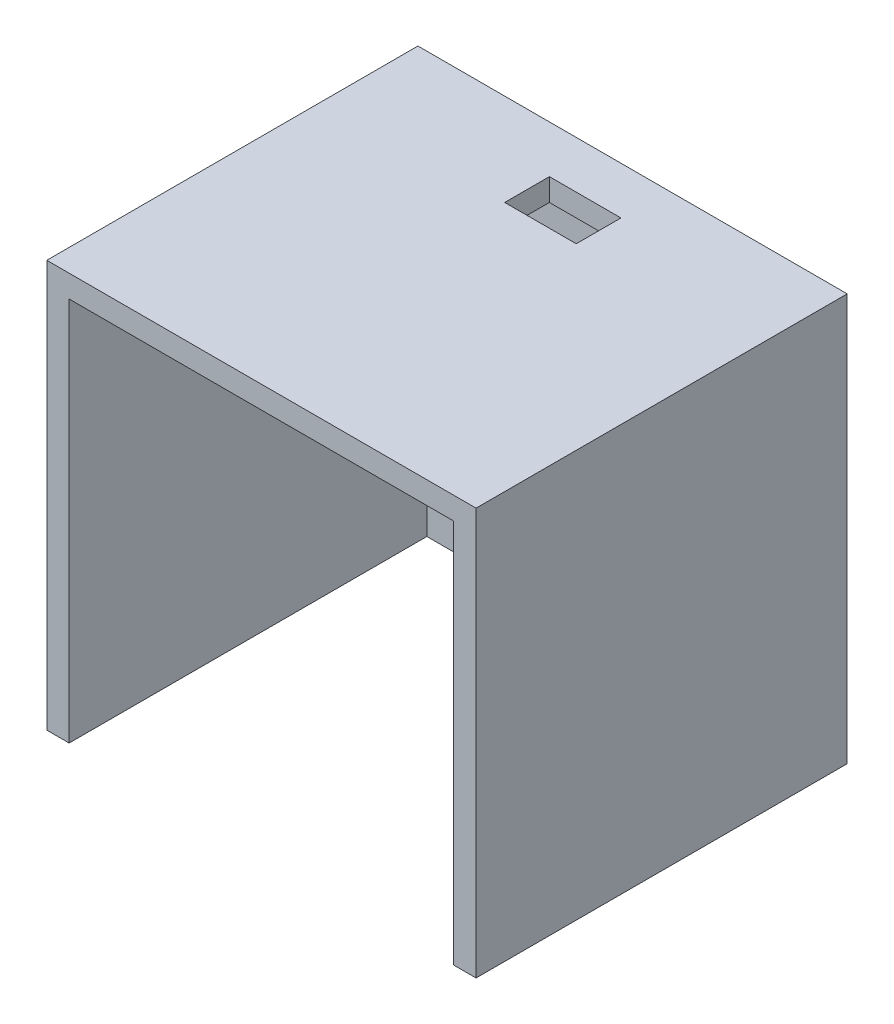
ISO-10303-21;
HEADER;
FILE_DESCRIPTION(('STEP AP214'),'2;1');
FILE_NAME('part.step','',(''),(''),'','','');
FILE_SCHEMA(('AUTOMOTIVE_DESIGN { 1 0 10303 214 1 1 1 1 }'));
ENDSEC;
DATA;
#1=APPLICATION_CONTEXT('core data for automotive mechanical design processes');
#2=APPLICATION_PROTOCOL_DEFINITION('international standard','automotive_design',2000,#1);
#3=PRODUCT_CONTEXT('',#1,'mechanical');
#4=PRODUCT('Part','Part','',(#3));
#5=PRODUCT_RELATED_PRODUCT_CATEGORY('part','',(#4));
#6=PRODUCT_DEFINITION_FORMATION('','',#4);
#7=PRODUCT_DEFINITION_CONTEXT('part definition',#1,'design');
#8=PRODUCT_DEFINITION('design','',#6,#7);
#9=PRODUCT_DEFINITION_SHAPE('','',#8);
#10=(LENGTH_UNIT() NAMED_UNIT(*) SI_UNIT(.MILLI.,.METRE.));
#11=(NAMED_UNIT(*) PLANE_ANGLE_UNIT() SI_UNIT($,.RADIAN.));
#12=(NAMED_UNIT(*) SI_UNIT($,.STERADIAN.) SOLID_ANGLE_UNIT());
#13=UNCERTAINTY_MEASURE_WITH_UNIT(LENGTH_MEASURE(1.E-05),#10,'distance_accuracy_value','');
#14=(GEOMETRIC_REPRESENTATION_CONTEXT(3) GLOBAL_UNCERTAINTY_ASSIGNED_CONTEXT((#13)) GLOBAL_UNIT_ASSIGNED_CONTEXT((#10,
#11,#12)) REPRESENTATION_CONTEXT('',''));
#15=CARTESIAN_POINT('',(0.,0.,0.));
#16=DIRECTION('',(0.,0.,1.));
#17=DIRECTION('',(1.,0.,0.));
#18=AXIS2_PLACEMENT_3D('',#15,#16,#17);
#19=CARTESIAN_POINT('',(0.,0.,40.));
#20=DIRECTION('',(0.,0.,-1.));
#21=DIRECTION('',(-1.,0.,0.));
#22=AXIS2_PLACEMENT_3D('',#19,#20,#21);
#23=PLANE('',#22);
#24=DIRECTION('',(0.,-1.,0.));
#25=VECTOR('',#24,1.);
#26=CARTESIAN_POINT('',(-2.49999999999993,43.0000000000001,40.));
#27=LINE('',#26,#25);
#28=CARTESIAN_POINT('',(-2.49999999999988,45.5000000000001,40.));
#29=VERTEX_POINT('',#28);
#30=CARTESIAN_POINT('',(-2.50000000000008,0.,40.));
#31=VERTEX_POINT('',#30);
#32=EDGE_CURVE('E154',#29,#31,#27,.T.);
#33=ORIENTED_EDGE('',*,*,#32,.T.);
#34=DIRECTION('',(-1.,0.,0.));
#35=VECTOR('',#34,1.);
#36=CARTESIAN_POINT('',(-4.22762533667264,0.,40.));
#37=LINE('',#36,#35);
#38=CARTESIAN_POINT('',(0.,0.,40.));
#39=VERTEX_POINT('',#38);
#40=EDGE_CURVE('E147',#39,#31,#37,.T.);
#41=ORIENTED_EDGE('',*,*,#40,.F.);
#42=DIRECTION('',(0.,-1.,0.));
#43=VECTOR('',#42,1.);
#44=CARTESIAN_POINT('',(0.,0.,40.));
#45=LINE('',#44,#43);
#46=CARTESIAN_POINT('',(0.,43.,40.));
#47=VERTEX_POINT('',#46);
#48=EDGE_CURVE('E184',#47,#39,#45,.T.);
#49=ORIENTED_EDGE('',*,*,#48,.F.);
#50=DIRECTION('',(-1.,0.,0.));
#51=VECTOR('',#50,1.);
#52=CARTESIAN_POINT('',(0.,43.,40.));
#53=LINE('',#52,#51);
#54=CARTESIAN_POINT('',(43.,43.,40.));
#55=VERTEX_POINT('',#54);
#56=EDGE_CURVE('E189',#55,#47,#53,.T.);
#57=ORIENTED_EDGE('',*,*,#56,.F.);
#58=DIRECTION('',(0.,1.,0.));
#59=VECTOR('',#58,1.);
#60=CARTESIAN_POINT('',(43.,0.,40.));
#61=LINE('',#60,#59);
#62=CARTESIAN_POINT('',(43.,0.,40.));
#63=VERTEX_POINT('',#62);
#64=EDGE_CURVE('E146',#63,#55,#61,.T.);
#65=ORIENTED_EDGE('',*,*,#64,.F.);
#66=CARTESIAN_POINT('',(45.5,0.,40.));
#67=VERTEX_POINT('',#66);
#68=EDGE_CURVE('E132',#67,#63,#37,.T.);
#69=ORIENTED_EDGE('',*,*,#68,.F.);
#70=DIRECTION('',(0.,1.,0.));
#71=VECTOR('',#70,1.);
#72=CARTESIAN_POINT('',(45.5000000000001,42.9999999999999,40.));
#73=LINE('',#72,#71);
#74=CARTESIAN_POINT('',(45.5000000000002,45.4999999999997,40.));
#75=VERTEX_POINT('',#74);
#76=EDGE_CURVE('E142',#67,#75,#73,.T.);
#77=ORIENTED_EDGE('',*,*,#76,.T.);
#78=DIRECTION('',(-1.,0.,0.));
#79=VECTOR('',#78,1.);
#80=CARTESIAN_POINT('',(-2.49999999999988,45.5000000000001,40.));
#81=LINE('',#80,#79);
#82=EDGE_CURVE('E151',#75,#29,#81,.T.);
#83=ORIENTED_EDGE('',*,*,#82,.T.);
#84=EDGE_LOOP('',(#33,#41,#49,#57,#65,#69,#77,#83));
#85=FACE_BOUND('',#84,.T.);
#86=ADVANCED_FACE('F41',(#85),#23,.F.);
#87=CARTESIAN_POINT('',(-2.49999999999988,45.5000000000001,40.));
#88=DIRECTION('',(0.,-1.,0.));
#89=DIRECTION('',(1.,0.,0.));
#90=AXIS2_PLACEMENT_3D('',#87,#88,#89);
#91=PLANE('',#90);
#92=DIRECTION('',(0.,0.,-1.));
#93=VECTOR('',#92,1.);
#94=CARTESIAN_POINT('',(25.5000000000001,45.4999999999999,3.79999999999999));
#95=LINE('',#94,#93);
#96=CARTESIAN_POINT('',(25.5000000000001,45.4999999999999,8.79999999999998));
#97=VERTEX_POINT('',#96);
#98=CARTESIAN_POINT('',(25.5000000000001,45.4999999999999,3.79999999999999));
#99=VERTEX_POINT('',#98);
#100=EDGE_CURVE('E233',#97,#99,#95,.T.);
#101=ORIENTED_EDGE('',*,*,#100,.F.);
#102=DIRECTION('',(1.,0.,0.));
#103=VECTOR('',#102,1.);
#104=CARTESIAN_POINT('',(25.5000000000001,45.4999999999999,8.79999999999998));
#105=LINE('',#104,#103);
#106=CARTESIAN_POINT('',(17.5,45.5,8.79999999999999));
#107=VERTEX_POINT('',#106);
#108=EDGE_CURVE('E230',#107,#97,#105,.T.);
#109=ORIENTED_EDGE('',*,*,#108,.F.);
#110=DIRECTION('',(0.,0.,1.));
#111=VECTOR('',#110,1.);
#112=CARTESIAN_POINT('',(17.5,45.5,3.8));
#113=LINE('',#112,#111);
#114=CARTESIAN_POINT('',(17.5,45.5,3.8));
#115=VERTEX_POINT('',#114);
#116=EDGE_CURVE('E227',#115,#107,#113,.T.);
#117=ORIENTED_EDGE('',*,*,#116,.F.);
#118=DIRECTION('',(-1.,0.,0.));
#119=VECTOR('',#118,1.);
#120=CARTESIAN_POINT('',(17.5,45.5,3.8));
#121=LINE('',#120,#119);
#122=EDGE_CURVE('E64',#99,#115,#121,.T.);
#123=ORIENTED_EDGE('',*,*,#122,.F.);
#124=EDGE_LOOP('',(#101,#109,#117,#123));
#125=FACE_BOUND('',#124,.T.);
#126=DIRECTION('',(0.,0.,-1.));
#127=VECTOR('',#126,1.);
#128=CARTESIAN_POINT('',(45.5000000000002,45.4999999999997,40.));
#129=LINE('',#128,#127);
#130=CARTESIAN_POINT('',(45.5,45.5000000000001,-1.5));
#131=VERTEX_POINT('',#130);
#132=EDGE_CURVE('E11',#75,#131,#129,.T.);
#133=ORIENTED_EDGE('',*,*,#132,.T.);
#134=DIRECTION('',(-1.,0.,0.));
#135=VECTOR('',#134,1.);
#136=CARTESIAN_POINT('',(-2.49999999999988,45.5000000000001,-1.5));
#137=LINE('',#136,#135);
#138=CARTESIAN_POINT('',(-2.49999999999988,45.5000000000001,-1.5));
#139=VERTEX_POINT('',#138);
#140=EDGE_CURVE('E173',#131,#139,#137,.T.);
#141=ORIENTED_EDGE('',*,*,#140,.T.);
#142=DIRECTION('',(0.,0.,-1.));
#143=VECTOR('',#142,1.);
#144=CARTESIAN_POINT('',(-2.49999999999988,45.5000000000001,40.));
#145=LINE('',#144,#143);
#146=EDGE_CURVE('E49',#29,#139,#145,.T.);
#147=ORIENTED_EDGE('',*,*,#146,.F.);
#148=ORIENTED_EDGE('',*,*,#82,.F.);
#149=EDGE_LOOP('',(#133,#141,#147,#148));
#150=FACE_BOUND('',#149,.T.);
#151=ADVANCED_FACE('F43',(#125,#150),#91,.F.);
#152=CARTESIAN_POINT('',(-2.49999999999993,43.0000000000001,40.));
#153=DIRECTION('',(1.,0.,0.));
#154=DIRECTION('',(0.,1.,0.));
#155=AXIS2_PLACEMENT_3D('',#152,#153,#154);
#156=PLANE('',#155);
#157=DIRECTION('',(0.,-1.,0.));
#158=VECTOR('',#157,1.);
#159=CARTESIAN_POINT('',(-2.49999999999988,45.5000000000001,-1.5));
#160=LINE('',#159,#158);
#161=CARTESIAN_POINT('',(-2.49999999999988,0.,-1.5));
#162=VERTEX_POINT('',#161);
#163=EDGE_CURVE('E167',#139,#162,#160,.T.);
#164=ORIENTED_EDGE('',*,*,#163,.T.);
#165=DIRECTION('',(0.,0.,-1.));
#166=VECTOR('',#165,1.);
#167=CARTESIAN_POINT('',(-2.50000000000007,0.,-1.501));
#168=LINE('',#167,#166);
#169=EDGE_CURVE('E56',#31,#162,#168,.T.);
#170=ORIENTED_EDGE('',*,*,#169,.F.);
#171=ORIENTED_EDGE('',*,*,#32,.F.);
#172=ORIENTED_EDGE('',*,*,#146,.T.);
#173=EDGE_LOOP('',(#164,#170,#171,#172));
#174=FACE_BOUND('',#173,.T.);
#175=ADVANCED_FACE('F166',(#174),#156,.F.);
#176=CARTESIAN_POINT('',(45.5000000000001,42.9999999999999,40.));
#177=DIRECTION('',(-1.,0.,0.));
#178=DIRECTION('',(0.,-1.,0.));
#179=AXIS2_PLACEMENT_3D('',#176,#177,#178);
#180=PLANE('',#179);
#181=ORIENTED_EDGE('',*,*,#76,.F.);
#182=DIRECTION('',(0.,0.,1.));
#183=VECTOR('',#182,1.);
#184=CARTESIAN_POINT('',(45.5,0.,-1.501));
#185=LINE('',#184,#183);
#186=CARTESIAN_POINT('',(45.5,0.,-1.5));
#187=VERTEX_POINT('',#186);
#188=EDGE_CURVE('E129',#187,#67,#185,.T.);
#189=ORIENTED_EDGE('',*,*,#188,.F.);
#190=DIRECTION('',(0.,1.,0.));
#191=VECTOR('',#190,1.);
#192=CARTESIAN_POINT('',(45.5,45.5000000000001,-1.5));
#193=LINE('',#192,#191);
#194=EDGE_CURVE('E174',#187,#131,#193,.T.);
#195=ORIENTED_EDGE('',*,*,#194,.T.);
#196=ORIENTED_EDGE('',*,*,#132,.F.);
#197=EDGE_LOOP('',(#181,#189,#195,#196));
#198=FACE_BOUND('',#197,.T.);
#199=ADVANCED_FACE('F150',(#198),#180,.F.);
#200=CARTESIAN_POINT('',(0.,0.,40.));
#201=DIRECTION('',(1.,0.,0.));
#202=DIRECTION('',(0.,0.,-1.));
#203=AXIS2_PLACEMENT_3D('',#200,#201,#202);
#204=PLANE('',#203);
#205=DIRECTION('',(0.,-1.,0.));
#206=VECTOR('',#205,1.);
#207=CARTESIAN_POINT('',(0.,0.,0.));
#208=LINE('',#207,#206);
#209=CARTESIAN_POINT('',(0.,43.,0.));
#210=VERTEX_POINT('',#209);
#211=CARTESIAN_POINT('',(0.,0.,0.));
#212=VERTEX_POINT('',#211);
#213=EDGE_CURVE('E177',#210,#212,#208,.T.);
#214=ORIENTED_EDGE('',*,*,#213,.F.);
#215=DIRECTION('',(0.,0.,-1.));
#216=VECTOR('',#215,1.);
#217=CARTESIAN_POINT('',(0.,43.,40.));
#218=LINE('',#217,#216);
#219=EDGE_CURVE('E190',#47,#210,#218,.T.);
#220=ORIENTED_EDGE('',*,*,#219,.F.);
#221=ORIENTED_EDGE('',*,*,#48,.T.);
#222=DIRECTION('',(0.,0.,-1.));
#223=VECTOR('',#222,1.);
#224=CARTESIAN_POINT('',(0.,0.,40.));
#225=LINE('',#224,#223);
#226=EDGE_CURVE('E152',#39,#212,#225,.T.);
#227=ORIENTED_EDGE('',*,*,#226,.T.);
#228=EDGE_LOOP('',(#214,#220,#221,#227));
#229=FACE_BOUND('',#228,.T.);
#230=ADVANCED_FACE('F210',(#229),#204,.T.);
#231=CARTESIAN_POINT('',(43.,0.,40.));
#232=DIRECTION('',(-1.,0.,0.));
#233=DIRECTION('',(0.,0.,1.));
#234=AXIS2_PLACEMENT_3D('',#231,#232,#233);
#235=PLANE('',#234);
#236=DIRECTION('',(0.,1.,0.));
#237=VECTOR('',#236,1.);
#238=CARTESIAN_POINT('',(43.,0.,0.));
#239=LINE('',#238,#237);
#240=CARTESIAN_POINT('',(43.,0.,0.));
#241=VERTEX_POINT('',#240);
#242=CARTESIAN_POINT('',(43.,43.,0.));
#243=VERTEX_POINT('',#242);
#244=EDGE_CURVE('E194',#241,#243,#239,.T.);
#245=ORIENTED_EDGE('',*,*,#244,.F.);
#246=DIRECTION('',(0.,0.,-1.));
#247=VECTOR('',#246,1.);
#248=CARTESIAN_POINT('',(43.,0.,40.));
#249=LINE('',#248,#247);
#250=EDGE_CURVE('E157',#63,#241,#249,.T.);
#251=ORIENTED_EDGE('',*,*,#250,.F.);
#252=ORIENTED_EDGE('',*,*,#64,.T.);
#253=DIRECTION('',(0.,0.,-1.));
#254=VECTOR('',#253,1.);
#255=CARTESIAN_POINT('',(43.,43.,40.));
#256=LINE('',#255,#254);
#257=EDGE_CURVE('E201',#55,#243,#256,.T.);
#258=ORIENTED_EDGE('',*,*,#257,.T.);
#259=EDGE_LOOP('',(#245,#251,#252,#258));
#260=FACE_BOUND('',#259,.T.);
#261=ADVANCED_FACE('F205',(#260),#235,.T.);
#262=CARTESIAN_POINT('',(0.,43.,40.));
#263=DIRECTION('',(0.,-1.,0.));
#264=DIRECTION('',(0.,0.,-1.));
#265=AXIS2_PLACEMENT_3D('',#262,#263,#264);
#266=PLANE('',#265);
#267=DIRECTION('',(1.,0.,0.));
#268=VECTOR('',#267,1.);
#269=CARTESIAN_POINT('',(25.4999999999997,43.,8.79999999999998));
#270=LINE('',#269,#268);
#271=CARTESIAN_POINT('',(17.5,43.,8.79999999999999));
#272=VERTEX_POINT('',#271);
#273=CARTESIAN_POINT('',(25.5,43.,8.79999999999998));
#274=VERTEX_POINT('',#273);
#275=EDGE_CURVE('E175',#272,#274,#270,.T.);
#276=ORIENTED_EDGE('',*,*,#275,.T.);
#277=DIRECTION('',(0.,0.,-1.));
#278=VECTOR('',#277,1.);
#279=CARTESIAN_POINT('',(25.5,43.,3.79999999999999));
#280=LINE('',#279,#278);
#281=CARTESIAN_POINT('',(25.5,43.,3.79999999999999));
#282=VERTEX_POINT('',#281);
#283=EDGE_CURVE('E218',#274,#282,#280,.T.);
#284=ORIENTED_EDGE('',*,*,#283,.T.);
#285=DIRECTION('',(-1.,0.,0.));
#286=VECTOR('',#285,1.);
#287=CARTESIAN_POINT('',(17.4999999999997,43.,3.8));
#288=LINE('',#287,#286);
#289=CARTESIAN_POINT('',(17.4999999999997,43.,3.8));
#290=VERTEX_POINT('',#289);
#291=EDGE_CURVE('E221',#282,#290,#288,.T.);
#292=ORIENTED_EDGE('',*,*,#291,.T.);
#293=DIRECTION('',(0.,0.,1.));
#294=VECTOR('',#293,1.);
#295=CARTESIAN_POINT('',(17.5,43.,3.8));
#296=LINE('',#295,#294);
#297=EDGE_CURVE('E224',#290,#272,#296,.T.);
#298=ORIENTED_EDGE('',*,*,#297,.T.);
#299=EDGE_LOOP('',(#276,#284,#292,#298));
#300=FACE_BOUND('',#299,.T.);
#301=DIRECTION('',(-1.,0.,0.));
#302=VECTOR('',#301,1.);
#303=CARTESIAN_POINT('',(0.,43.,0.));
#304=LINE('',#303,#302);
#305=EDGE_CURVE('E187',#243,#210,#304,.T.);
#306=ORIENTED_EDGE('',*,*,#305,.F.);
#307=ORIENTED_EDGE('',*,*,#257,.F.);
#308=ORIENTED_EDGE('',*,*,#56,.T.);
#309=ORIENTED_EDGE('',*,*,#219,.T.);
#310=EDGE_LOOP('',(#306,#307,#308,#309));
#311=FACE_BOUND('',#310,.T.);
#312=ADVANCED_FACE('F213',(#300,#311),#266,.T.);
#313=CARTESIAN_POINT('',(0.,0.,0.));
#314=DIRECTION('',(0.,0.,1.));
#315=DIRECTION('',(1.,0.,0.));
#316=AXIS2_PLACEMENT_3D('',#313,#314,#315);
#317=PLANE('',#316);
#318=ORIENTED_EDGE('',*,*,#244,.T.);
#319=ORIENTED_EDGE('',*,*,#305,.T.);
#320=ORIENTED_EDGE('',*,*,#213,.T.);
#321=DIRECTION('',(1.,0.,0.));
#322=VECTOR('',#321,1.);
#323=CARTESIAN_POINT('',(0.,0.,0.));
#324=LINE('',#323,#322);
#325=EDGE_CURVE('E180',#212,#241,#324,.T.);
#326=ORIENTED_EDGE('',*,*,#325,.T.);
#327=EDGE_LOOP('',(#318,#319,#320,#326));
#328=FACE_BOUND('',#327,.T.);
#329=ADVANCED_FACE('F207',(#328),#317,.T.);
#330=CARTESIAN_POINT('',(0.,0.,-1.5));
#331=DIRECTION('',(0.,0.,1.));
#332=DIRECTION('',(1.,0.,0.));
#333=AXIS2_PLACEMENT_3D('',#330,#331,#332);
#334=PLANE('',#333);
#335=ORIENTED_EDGE('',*,*,#194,.F.);
#336=DIRECTION('',(1.,0.,0.));
#337=VECTOR('',#336,1.);
#338=CARTESIAN_POINT('',(-4.22762533667264,0.,-1.5));
#339=LINE('',#338,#337);
#340=EDGE_CURVE('E134',#162,#187,#339,.T.);
#341=ORIENTED_EDGE('',*,*,#340,.F.);
#342=ORIENTED_EDGE('',*,*,#163,.F.);
#343=ORIENTED_EDGE('',*,*,#140,.F.);
#344=EDGE_LOOP('',(#335,#341,#342,#343));
#345=FACE_BOUND('',#344,.T.);
#346=ADVANCED_FACE('F172',(#345),#334,.F.);
#347=CARTESIAN_POINT('',(25.4999999999997,-2.50100000000019,8.79999999999998));
#348=DIRECTION('',(0.,0.,1.));
#349=DIRECTION('',(1.,0.,0.));
#350=AXIS2_PLACEMENT_3D('',#347,#348,#349);
#351=PLANE('',#350);
#352=DIRECTION('',(0.,1.,0.));
#353=VECTOR('',#352,1.);
#354=CARTESIAN_POINT('',(17.4999999999997,-2.50100000000013,8.79999999999999));
#355=LINE('',#354,#353);
#356=EDGE_CURVE('E237',#272,#107,#355,.T.);
#357=ORIENTED_EDGE('',*,*,#356,.T.);
#358=ORIENTED_EDGE('',*,*,#108,.T.);
#359=DIRECTION('',(0.,1.,0.));
#360=VECTOR('',#359,1.);
#361=CARTESIAN_POINT('',(25.4999999999997,-2.50100000000019,8.79999999999998));
#362=LINE('',#361,#360);
#363=EDGE_CURVE('E242',#274,#97,#362,.T.);
#364=ORIENTED_EDGE('',*,*,#363,.F.);
#365=ORIENTED_EDGE('',*,*,#275,.F.);
#366=EDGE_LOOP('',(#357,#358,#364,#365));
#367=FACE_BOUND('',#366,.T.);
#368=ADVANCED_FACE('F250',(#367),#351,.F.);
#369=CARTESIAN_POINT('',(25.4999999999997,-2.50100000000019,3.79999999999999));
#370=DIRECTION('',(1.,0.,0.));
#371=DIRECTION('',(0.,1.,0.));
#372=AXIS2_PLACEMENT_3D('',#369,#370,#371);
#373=PLANE('',#372);
#374=ORIENTED_EDGE('',*,*,#363,.T.);
#375=ORIENTED_EDGE('',*,*,#100,.T.);
#376=DIRECTION('',(0.,1.,0.));
#377=VECTOR('',#376,1.);
#378=CARTESIAN_POINT('',(25.4999999999997,-2.50100000000019,3.79999999999999));
#379=LINE('',#378,#377);
#380=EDGE_CURVE('E240',#282,#99,#379,.T.);
#381=ORIENTED_EDGE('',*,*,#380,.F.);
#382=ORIENTED_EDGE('',*,*,#283,.F.);
#383=EDGE_LOOP('',(#374,#375,#381,#382));
#384=FACE_BOUND('',#383,.T.);
#385=ADVANCED_FACE('F254',(#384),#373,.F.);
#386=CARTESIAN_POINT('',(17.4999999999997,-2.50100000000013,3.8));
#387=DIRECTION('',(0.,0.,-1.));
#388=DIRECTION('',(-1.,0.,0.));
#389=AXIS2_PLACEMENT_3D('',#386,#387,#388);
#390=PLANE('',#389);
#391=ORIENTED_EDGE('',*,*,#380,.T.);
#392=ORIENTED_EDGE('',*,*,#122,.T.);
#393=DIRECTION('',(0.,1.,0.));
#394=VECTOR('',#393,1.);
#395=CARTESIAN_POINT('',(17.4999999999997,-2.50100000000013,3.8));
#396=LINE('',#395,#394);
#397=EDGE_CURVE('E238',#290,#115,#396,.T.);
#398=ORIENTED_EDGE('',*,*,#397,.F.);
#399=ORIENTED_EDGE('',*,*,#291,.F.);
#400=EDGE_LOOP('',(#391,#392,#398,#399));
#401=FACE_BOUND('',#400,.T.);
#402=ADVANCED_FACE('F256',(#401),#390,.F.);
#403=CARTESIAN_POINT('',(17.4999999999997,-2.50100000000013,3.8));
#404=DIRECTION('',(-1.,0.,0.));
#405=DIRECTION('',(0.,-1.,0.));
#406=AXIS2_PLACEMENT_3D('',#403,#404,#405);
#407=PLANE('',#406);
#408=ORIENTED_EDGE('',*,*,#397,.T.);
#409=ORIENTED_EDGE('',*,*,#116,.T.);
#410=ORIENTED_EDGE('',*,*,#356,.F.);
#411=ORIENTED_EDGE('',*,*,#297,.F.);
#412=EDGE_LOOP('',(#408,#409,#410,#411));
#413=FACE_BOUND('',#412,.T.);
#414=ADVANCED_FACE('F259',(#413),#407,.F.);
#415=CARTESIAN_POINT('',(-4.22762533667264,0.,-1.501));
#416=DIRECTION('',(0.,1.,0.));
#417=DIRECTION('',(0.,0.,1.));
#418=AXIS2_PLACEMENT_3D('',#415,#416,#417);
#419=PLANE('',#418);
#420=ORIENTED_EDGE('',*,*,#226,.F.);
#421=ORIENTED_EDGE('',*,*,#40,.T.);
#422=ORIENTED_EDGE('',*,*,#169,.T.);
#423=ORIENTED_EDGE('',*,*,#340,.T.);
#424=ORIENTED_EDGE('',*,*,#188,.T.);
#425=ORIENTED_EDGE('',*,*,#68,.T.);
#426=ORIENTED_EDGE('',*,*,#250,.T.);
#427=ORIENTED_EDGE('',*,*,#325,.F.);
#428=EDGE_LOOP('',(#420,#421,#422,#423,#424,#425,#426,#427));
#429=FACE_BOUND('',#428,.T.);
#430=ADVANCED_FACE('F131',(#429),#419,.F.);
#431=CLOSED_SHELL('',(#86,#151,#175,#199,#230,#261,#312,#329,#346,#368,#385,#402,#414,#430));
#432=MANIFOLD_SOLID_BREP('B2',#431);
#433=ADVANCED_BREP_SHAPE_REPRESENTATION('',(#18,#432),#14);
#434=SHAPE_DEFINITION_REPRESENTATION(#9,#433);
ENDSEC;
END-ISO-10303-21;
